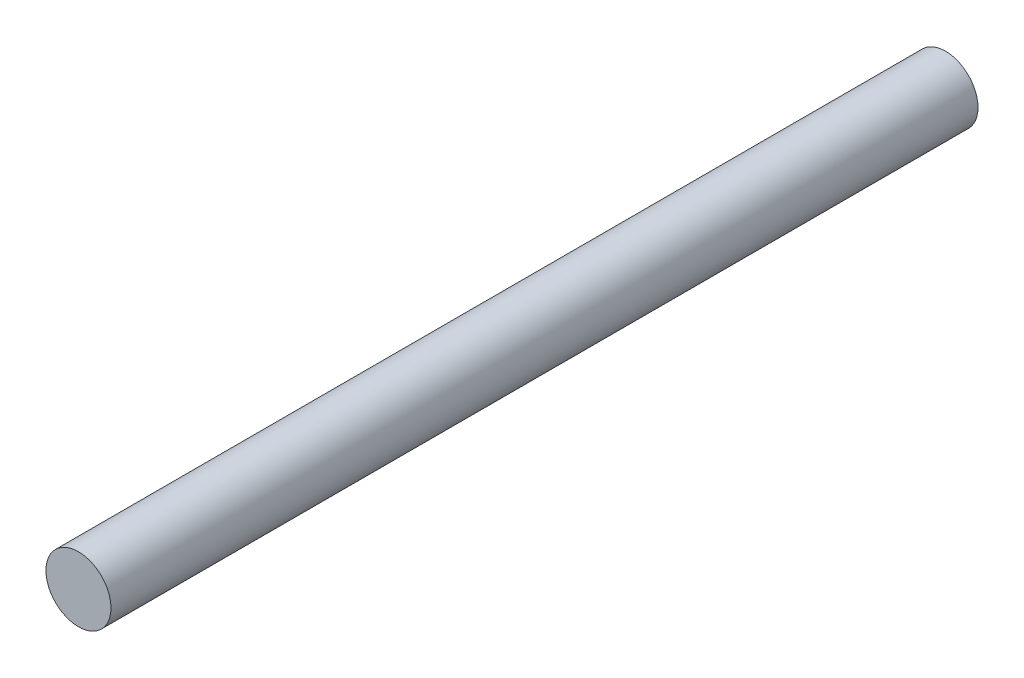
ISO-10303-21;
HEADER;
FILE_DESCRIPTION(('STEP AP214'),'2;1');
FILE_NAME('part.step','',(''),(''),'','','');
FILE_SCHEMA(('AUTOMOTIVE_DESIGN { 1 0 10303 214 1 1 1 1 }'));
ENDSEC;
DATA;
#1=APPLICATION_CONTEXT('core data for automotive mechanical design processes');
#2=APPLICATION_PROTOCOL_DEFINITION('international standard','automotive_design',2000,#1);
#3=PRODUCT_CONTEXT('',#1,'mechanical');
#4=PRODUCT('Part','Part','',(#3));
#5=PRODUCT_RELATED_PRODUCT_CATEGORY('part','',(#4));
#6=PRODUCT_DEFINITION_FORMATION('','',#4);
#7=PRODUCT_DEFINITION_CONTEXT('part definition',#1,'design');
#8=PRODUCT_DEFINITION('design','',#6,#7);
#9=PRODUCT_DEFINITION_SHAPE('','',#8);
#10=(LENGTH_UNIT() NAMED_UNIT(*) SI_UNIT(.MILLI.,.METRE.));
#11=(NAMED_UNIT(*) PLANE_ANGLE_UNIT() SI_UNIT($,.RADIAN.));
#12=(NAMED_UNIT(*) SI_UNIT($,.STERADIAN.) SOLID_ANGLE_UNIT());
#13=UNCERTAINTY_MEASURE_WITH_UNIT(LENGTH_MEASURE(1.E-05),#10,'distance_accuracy_value','');
#14=(GEOMETRIC_REPRESENTATION_CONTEXT(3) GLOBAL_UNCERTAINTY_ASSIGNED_CONTEXT((#13)) GLOBAL_UNIT_ASSIGNED_CONTEXT((#10,
#11,#12)) REPRESENTATION_CONTEXT('',''));
#15=CARTESIAN_POINT('',(0.,0.,0.));
#16=DIRECTION('',(0.,0.,1.));
#17=DIRECTION('',(1.,0.,0.));
#18=AXIS2_PLACEMENT_3D('',#15,#16,#17);
#19=CARTESIAN_POINT('',(0.,0.,40.));
#20=DIRECTION('',(0.,0.,-1.));
#21=DIRECTION('',(-1.,0.,0.));
#22=AXIS2_PLACEMENT_3D('',#19,#20,#21);
#23=CYLINDRICAL_SURFACE('',#22,1.5);
#24=CARTESIAN_POINT('',(0.,0.,40.));
#25=DIRECTION('',(0.,0.,1.));
#26=DIRECTION('',(1.,0.,0.));
#27=AXIS2_PLACEMENT_3D('',#24,#25,#26);
#28=CIRCLE('',#27,1.5);
#29=CARTESIAN_POINT('',(1.5,0.,40.));
#30=VERTEX_POINT('',#29);
#31=EDGE_CURVE('E10',#30,#30,#28,.T.);
#32=ORIENTED_EDGE('',*,*,#31,.F.);
#33=EDGE_LOOP('',(#32));
#34=FACE_BOUND('',#33,.T.);
#35=CARTESIAN_POINT('',(0.,0.,0.));
#36=DIRECTION('',(0.,0.,1.));
#37=DIRECTION('',(1.,0.,0.));
#38=AXIS2_PLACEMENT_3D('',#35,#36,#37);
#39=CIRCLE('',#38,1.5);
#40=CARTESIAN_POINT('',(1.5,0.,0.));
#41=VERTEX_POINT('',#40);
#42=EDGE_CURVE('E40',#41,#41,#39,.T.);
#43=ORIENTED_EDGE('',*,*,#42,.T.);
#44=EDGE_LOOP('',(#43));
#45=FACE_BOUND('',#44,.T.);
#46=ADVANCED_FACE('F37',(#34,#45),#23,.T.);
#47=CARTESIAN_POINT('',(0.,0.,40.));
#48=DIRECTION('',(0.,0.,1.));
#49=DIRECTION('',(1.,0.,0.));
#50=AXIS2_PLACEMENT_3D('',#47,#48,#49);
#51=PLANE('',#50);
#52=ORIENTED_EDGE('',*,*,#31,.T.);
#53=EDGE_LOOP('',(#52));
#54=FACE_BOUND('',#53,.T.);
#55=ADVANCED_FACE('F54',(#54),#51,.T.);
#56=CARTESIAN_POINT('',(0.,0.,0.));
#57=DIRECTION('',(0.,0.,1.));
#58=DIRECTION('',(1.,0.,0.));
#59=AXIS2_PLACEMENT_3D('',#56,#57,#58);
#60=PLANE('',#59);
#61=ORIENTED_EDGE('',*,*,#42,.F.);
#62=EDGE_LOOP('',(#61));
#63=FACE_BOUND('',#62,.T.);
#64=ADVANCED_FACE('F52',(#63),#60,.F.);
#65=CLOSED_SHELL('',(#46,#55,#64));
#66=MANIFOLD_SOLID_BREP('B2',#65);
#67=ADVANCED_BREP_SHAPE_REPRESENTATION('',(#18,#66),#14);
#68=SHAPE_DEFINITION_REPRESENTATION(#9,#67);
ENDSEC;
END-ISO-10303-21;
